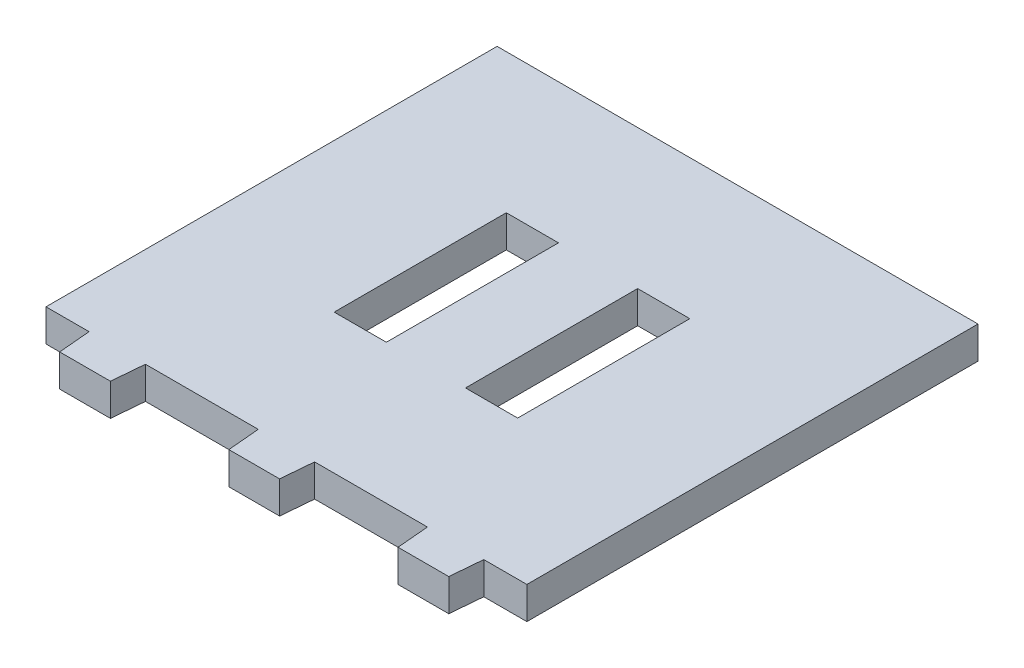
ISO-10303-21;
HEADER;
FILE_DESCRIPTION(('STEP AP214'),'2;1');
FILE_NAME('part.step','',(''),(''),'','','');
FILE_SCHEMA(('AUTOMOTIVE_DESIGN { 1 0 10303 214 1 1 1 1 }'));
ENDSEC;
DATA;
#1=APPLICATION_CONTEXT('core data for automotive mechanical design processes');
#2=APPLICATION_PROTOCOL_DEFINITION('international standard','automotive_design',2000,#1);
#3=PRODUCT_CONTEXT('',#1,'mechanical');
#4=PRODUCT('Part','Part','',(#3));
#5=PRODUCT_RELATED_PRODUCT_CATEGORY('part','',(#4));
#6=PRODUCT_DEFINITION_FORMATION('','',#4);
#7=PRODUCT_DEFINITION_CONTEXT('part definition',#1,'design');
#8=PRODUCT_DEFINITION('design','',#6,#7);
#9=PRODUCT_DEFINITION_SHAPE('','',#8);
#10=(LENGTH_UNIT() NAMED_UNIT(*) SI_UNIT(.MILLI.,.METRE.));
#11=(NAMED_UNIT(*) PLANE_ANGLE_UNIT() SI_UNIT($,.RADIAN.));
#12=(NAMED_UNIT(*) SI_UNIT($,.STERADIAN.) SOLID_ANGLE_UNIT());
#13=UNCERTAINTY_MEASURE_WITH_UNIT(LENGTH_MEASURE(1.E-05),#10,'distance_accuracy_value','');
#14=(GEOMETRIC_REPRESENTATION_CONTEXT(3) GLOBAL_UNCERTAINTY_ASSIGNED_CONTEXT((#13)) GLOBAL_UNIT_ASSIGNED_CONTEXT((#10,
#11,#12)) REPRESENTATION_CONTEXT('',''));
#15=CARTESIAN_POINT('',(0.,0.,0.));
#16=DIRECTION('',(0.,0.,1.));
#17=DIRECTION('',(1.,0.,0.));
#18=AXIS2_PLACEMENT_3D('',#15,#16,#17);
#19=CARTESIAN_POINT('',(0.,5.715,-15.2642187617959));
#20=DIRECTION('',(0.,0.,1.));
#21=DIRECTION('',(1.,0.,0.));
#22=AXIS2_PLACEMENT_3D('',#19,#20,#21);
#23=PLANE('',#22);
#24=DIRECTION('',(-1.,0.,0.));
#25=VECTOR('',#24,1.);
#26=CARTESIAN_POINT('',(0.,0.,-15.2642187617959));
#27=LINE('',#26,#25);
#28=CARTESIAN_POINT('',(16.2715790770451,0.,-15.2642187617959));
#29=VERTEX_POINT('',#28);
#30=CARTESIAN_POINT('',(7.01863603659395,0.,-15.2642187617959));
#31=VERTEX_POINT('',#30);
#32=EDGE_CURVE('E335',#29,#31,#27,.T.);
#33=ORIENTED_EDGE('',*,*,#32,.F.);
#34=DIRECTION('',(0.,-1.,0.));
#35=VECTOR('',#34,1.);
#36=CARTESIAN_POINT('',(16.2715790770451,5.715,-15.2642187617959));
#37=LINE('',#36,#35);
#38=CARTESIAN_POINT('',(16.2715790770451,5.715,-15.2642187617959));
#39=VERTEX_POINT('',#38);
#40=EDGE_CURVE('E11',#39,#29,#37,.T.);
#41=ORIENTED_EDGE('',*,*,#40,.F.);
#42=DIRECTION('',(-1.,0.,0.));
#43=VECTOR('',#42,1.);
#44=CARTESIAN_POINT('',(0.,5.715,-15.2642187617959));
#45=LINE('',#44,#43);
#46=CARTESIAN_POINT('',(7.01863603659395,5.715,-15.2642187617959));
#47=VERTEX_POINT('',#46);
#48=EDGE_CURVE('E215',#39,#47,#45,.T.);
#49=ORIENTED_EDGE('',*,*,#48,.T.);
#50=DIRECTION('',(0.,-1.,0.));
#51=VECTOR('',#50,1.);
#52=CARTESIAN_POINT('',(7.01863603659395,5.715,-15.2642187617959));
#53=LINE('',#52,#51);
#54=EDGE_CURVE('E53',#47,#31,#53,.T.);
#55=ORIENTED_EDGE('',*,*,#54,.T.);
#56=EDGE_LOOP('',(#33,#41,#49,#55));
#57=FACE_BOUND('',#56,.T.);
#58=ADVANCED_FACE('F34',(#57),#23,.T.);
#59=CARTESIAN_POINT('',(16.2715790770451,5.715,0.));
#60=DIRECTION('',(1.,0.,0.));
#61=DIRECTION('',(0.,0.,-1.));
#62=AXIS2_PLACEMENT_3D('',#59,#60,#61);
#63=PLANE('',#62);
#64=DIRECTION('',(0.,0.,1.));
#65=VECTOR('',#64,1.);
#66=CARTESIAN_POINT('',(16.2715790770451,0.,0.));
#67=LINE('',#66,#65);
#68=CARTESIAN_POINT('',(16.2715790770451,0.,15.2642187617959));
#69=VERTEX_POINT('',#68);
#70=EDGE_CURVE('E220',#29,#69,#67,.T.);
#71=ORIENTED_EDGE('',*,*,#70,.T.);
#72=DIRECTION('',(0.,-1.,0.));
#73=VECTOR('',#72,1.);
#74=CARTESIAN_POINT('',(16.2715790770451,5.715,15.2642187617959));
#75=LINE('',#74,#73);
#76=CARTESIAN_POINT('',(16.2715790770451,5.715,15.2642187617959));
#77=VERTEX_POINT('',#76);
#78=EDGE_CURVE('E44',#77,#69,#75,.T.);
#79=ORIENTED_EDGE('',*,*,#78,.F.);
#80=DIRECTION('',(0.,0.,1.));
#81=VECTOR('',#80,1.);
#82=CARTESIAN_POINT('',(16.2715790770451,5.715,0.));
#83=LINE('',#82,#81);
#84=EDGE_CURVE('E210',#39,#77,#83,.T.);
#85=ORIENTED_EDGE('',*,*,#84,.F.);
#86=ORIENTED_EDGE('',*,*,#40,.T.);
#87=EDGE_LOOP('',(#71,#79,#85,#86));
#88=FACE_BOUND('',#87,.T.);
#89=ADVANCED_FACE('F218',(#88),#63,.F.);
#90=CARTESIAN_POINT('',(0.,5.715,15.2642187617959));
#91=DIRECTION('',(0.,0.,1.));
#92=DIRECTION('',(1.,0.,0.));
#93=AXIS2_PLACEMENT_3D('',#90,#91,#92);
#94=PLANE('',#93);
#95=DIRECTION('',(-1.,0.,0.));
#96=VECTOR('',#95,1.);
#97=CARTESIAN_POINT('',(0.,0.,15.2642187617959));
#98=LINE('',#97,#96);
#99=CARTESIAN_POINT('',(7.01863603659395,0.,15.2642187617959));
#100=VERTEX_POINT('',#99);
#101=EDGE_CURVE('E338',#69,#100,#98,.T.);
#102=ORIENTED_EDGE('',*,*,#101,.T.);
#103=DIRECTION('',(0.,-1.,0.));
#104=VECTOR('',#103,1.);
#105=CARTESIAN_POINT('',(7.01863603659395,5.715,15.2642187617959));
#106=LINE('',#105,#104);
#107=CARTESIAN_POINT('',(7.01863603659395,5.715,15.2642187617959));
#108=VERTEX_POINT('',#107);
#109=EDGE_CURVE('E127',#108,#100,#106,.T.);
#110=ORIENTED_EDGE('',*,*,#109,.F.);
#111=DIRECTION('',(-1.,0.,0.));
#112=VECTOR('',#111,1.);
#113=CARTESIAN_POINT('',(0.,5.715,15.2642187617959));
#114=LINE('',#113,#112);
#115=EDGE_CURVE('E202',#77,#108,#114,.T.);
#116=ORIENTED_EDGE('',*,*,#115,.F.);
#117=ORIENTED_EDGE('',*,*,#78,.T.);
#118=EDGE_LOOP('',(#102,#110,#116,#117));
#119=FACE_BOUND('',#118,.T.);
#120=ADVANCED_FACE('F204',(#119),#94,.F.);
#121=CARTESIAN_POINT('',(0.,5.715,-15.2642187617959));
#122=DIRECTION('',(0.,0.,-1.));
#123=DIRECTION('',(-1.,0.,0.));
#124=AXIS2_PLACEMENT_3D('',#121,#122,#123);
#125=PLANE('',#124);
#126=DIRECTION('',(1.,0.,0.));
#127=VECTOR('',#126,1.);
#128=CARTESIAN_POINT('',(0.,0.,-15.2642187617959));
#129=LINE('',#128,#127);
#130=CARTESIAN_POINT('',(-16.2715790770451,0.,-15.2642187617959));
#131=VERTEX_POINT('',#130);
#132=CARTESIAN_POINT('',(-7.01863603659395,0.,-15.2642187617959));
#133=VERTEX_POINT('',#132);
#134=EDGE_CURVE('E323',#131,#133,#129,.T.);
#135=ORIENTED_EDGE('',*,*,#134,.T.);
#136=DIRECTION('',(0.,-1.,0.));
#137=VECTOR('',#136,1.);
#138=CARTESIAN_POINT('',(-7.01863603659395,5.715,-15.2642187617959));
#139=LINE('',#138,#137);
#140=CARTESIAN_POINT('',(-7.01863603659395,5.715,-15.2642187617959));
#141=VERTEX_POINT('',#140);
#142=EDGE_CURVE('E231',#141,#133,#139,.T.);
#143=ORIENTED_EDGE('',*,*,#142,.F.);
#144=DIRECTION('',(1.,0.,0.));
#145=VECTOR('',#144,1.);
#146=CARTESIAN_POINT('',(0.,5.715,-15.2642187617959));
#147=LINE('',#146,#145);
#148=CARTESIAN_POINT('',(-16.2715790770451,5.715,-15.2642187617959));
#149=VERTEX_POINT('',#148);
#150=EDGE_CURVE('E378',#149,#141,#147,.T.);
#151=ORIENTED_EDGE('',*,*,#150,.F.);
#152=DIRECTION('',(0.,-1.,0.));
#153=VECTOR('',#152,1.);
#154=CARTESIAN_POINT('',(-16.2715790770451,5.715,-15.2642187617959));
#155=LINE('',#154,#153);
#156=EDGE_CURVE('E225',#149,#131,#155,.T.);
#157=ORIENTED_EDGE('',*,*,#156,.T.);
#158=EDGE_LOOP('',(#135,#143,#151,#157));
#159=FACE_BOUND('',#158,.T.);
#160=ADVANCED_FACE('F424',(#159),#125,.F.);
#161=CARTESIAN_POINT('',(-7.01863603659395,5.715,0.));
#162=DIRECTION('',(1.,0.,0.));
#163=DIRECTION('',(0.,0.,-1.));
#164=AXIS2_PLACEMENT_3D('',#161,#162,#163);
#165=PLANE('',#164);
#166=DIRECTION('',(0.,0.,1.));
#167=VECTOR('',#166,1.);
#168=CARTESIAN_POINT('',(-7.01863603659395,0.,0.));
#169=LINE('',#168,#167);
#170=CARTESIAN_POINT('',(-7.01863603659395,0.,15.2642187617959));
#171=VERTEX_POINT('',#170);
#172=EDGE_CURVE('E326',#133,#171,#169,.T.);
#173=ORIENTED_EDGE('',*,*,#172,.T.);
#174=DIRECTION('',(0.,-1.,0.));
#175=VECTOR('',#174,1.);
#176=CARTESIAN_POINT('',(-7.01863603659395,5.715,15.2642187617959));
#177=LINE('',#176,#175);
#178=CARTESIAN_POINT('',(-7.01863603659395,5.715,15.2642187617959));
#179=VERTEX_POINT('',#178);
#180=EDGE_CURVE('E229',#179,#171,#177,.T.);
#181=ORIENTED_EDGE('',*,*,#180,.F.);
#182=DIRECTION('',(0.,0.,1.));
#183=VECTOR('',#182,1.);
#184=CARTESIAN_POINT('',(-7.01863603659395,5.715,0.));
#185=LINE('',#184,#183);
#186=EDGE_CURVE('E381',#141,#179,#185,.T.);
#187=ORIENTED_EDGE('',*,*,#186,.F.);
#188=ORIENTED_EDGE('',*,*,#142,.T.);
#189=EDGE_LOOP('',(#173,#181,#187,#188));
#190=FACE_BOUND('',#189,.T.);
#191=ADVANCED_FACE('F420',(#190),#165,.F.);
#192=CARTESIAN_POINT('',(0.,5.715,15.2642187617959));
#193=DIRECTION('',(0.,0.,-1.));
#194=DIRECTION('',(-1.,0.,0.));
#195=AXIS2_PLACEMENT_3D('',#192,#193,#194);
#196=PLANE('',#195);
#197=DIRECTION('',(1.,0.,0.));
#198=VECTOR('',#197,1.);
#199=CARTESIAN_POINT('',(0.,0.,15.2642187617959));
#200=LINE('',#199,#198);
#201=CARTESIAN_POINT('',(-16.2715790770451,0.,15.2642187617959));
#202=VERTEX_POINT('',#201);
#203=EDGE_CURVE('E329',#202,#171,#200,.T.);
#204=ORIENTED_EDGE('',*,*,#203,.F.);
#205=DIRECTION('',(0.,-1.,0.));
#206=VECTOR('',#205,1.);
#207=CARTESIAN_POINT('',(-16.2715790770451,5.715,15.2642187617959));
#208=LINE('',#207,#206);
#209=CARTESIAN_POINT('',(-16.2715790770451,5.715,15.2642187617959));
#210=VERTEX_POINT('',#209);
#211=EDGE_CURVE('E227',#210,#202,#208,.T.);
#212=ORIENTED_EDGE('',*,*,#211,.F.);
#213=DIRECTION('',(1.,0.,0.));
#214=VECTOR('',#213,1.);
#215=CARTESIAN_POINT('',(0.,5.715,15.2642187617959));
#216=LINE('',#215,#214);
#217=EDGE_CURVE('E383',#210,#179,#216,.T.);
#218=ORIENTED_EDGE('',*,*,#217,.T.);
#219=ORIENTED_EDGE('',*,*,#180,.T.);
#220=EDGE_LOOP('',(#204,#212,#218,#219));
#221=FACE_BOUND('',#220,.T.);
#222=ADVANCED_FACE('F417',(#221),#196,.T.);
#223=CARTESIAN_POINT('',(42.6397952780144,5.715,0.));
#224=DIRECTION('',(1.,0.,0.));
#225=DIRECTION('',(0.,0.,-1.));
#226=AXIS2_PLACEMENT_3D('',#223,#224,#225);
#227=PLANE('',#226);
#228=DIRECTION('',(0.,0.,1.));
#229=VECTOR('',#228,1.);
#230=CARTESIAN_POINT('',(42.6397952780144,0.,0.));
#231=LINE('',#230,#229);
#232=CARTESIAN_POINT('',(42.6397952780144,0.,-40.));
#233=VERTEX_POINT('',#232);
#234=CARTESIAN_POINT('',(42.6397952780144,0.,40.));
#235=VERTEX_POINT('',#234);
#236=EDGE_CURVE('E279',#233,#235,#231,.T.);
#237=ORIENTED_EDGE('',*,*,#236,.F.);
#238=DIRECTION('',(0.,-1.,0.));
#239=VECTOR('',#238,1.);
#240=CARTESIAN_POINT('',(42.6397952780144,5.715,-40.));
#241=LINE('',#240,#239);
#242=CARTESIAN_POINT('',(42.6397952780144,5.715,-40.));
#243=VERTEX_POINT('',#242);
#244=EDGE_CURVE('E38',#243,#233,#241,.T.);
#245=ORIENTED_EDGE('',*,*,#244,.F.);
#246=DIRECTION('',(0.,0.,1.));
#247=VECTOR('',#246,1.);
#248=CARTESIAN_POINT('',(42.6397952780144,5.715,0.));
#249=LINE('',#248,#247);
#250=CARTESIAN_POINT('',(42.6397952780144,5.715,40.));
#251=VERTEX_POINT('',#250);
#252=EDGE_CURVE('E342',#243,#251,#249,.T.);
#253=ORIENTED_EDGE('',*,*,#252,.T.);
#254=DIRECTION('',(0.,-1.,0.));
#255=VECTOR('',#254,1.);
#256=CARTESIAN_POINT('',(42.6397952780144,5.715,40.));
#257=LINE('',#256,#255);
#258=EDGE_CURVE('E234',#251,#235,#257,.T.);
#259=ORIENTED_EDGE('',*,*,#258,.T.);
#260=EDGE_LOOP('',(#237,#245,#253,#259));
#261=FACE_BOUND('',#260,.T.);
#262=ADVANCED_FACE('F36',(#261),#227,.T.);
#263=CARTESIAN_POINT('',(0.,5.715,-40.));
#264=DIRECTION('',(0.,0.,-1.));
#265=DIRECTION('',(-1.,0.,0.));
#266=AXIS2_PLACEMENT_3D('',#263,#264,#265);
#267=PLANE('',#266);
#268=DIRECTION('',(1.,0.,0.));
#269=VECTOR('',#268,1.);
#270=CARTESIAN_POINT('',(0.,0.,-40.));
#271=LINE('',#270,#269);
#272=CARTESIAN_POINT('',(-42.6397952780144,0.,-40.));
#273=VERTEX_POINT('',#272);
#274=EDGE_CURVE('E275',#273,#233,#271,.T.);
#275=ORIENTED_EDGE('',*,*,#274,.F.);
#276=DIRECTION('',(0.,-1.,0.));
#277=VECTOR('',#276,1.);
#278=CARTESIAN_POINT('',(-42.6397952780144,5.715,-40.));
#279=LINE('',#278,#277);
#280=CARTESIAN_POINT('',(-42.6397952780144,5.715,-40.));
#281=VERTEX_POINT('',#280);
#282=EDGE_CURVE('E266',#281,#273,#279,.T.);
#283=ORIENTED_EDGE('',*,*,#282,.F.);
#284=DIRECTION('',(1.,0.,0.));
#285=VECTOR('',#284,1.);
#286=CARTESIAN_POINT('',(0.,5.715,-40.));
#287=LINE('',#286,#285);
#288=EDGE_CURVE('E277',#281,#243,#287,.T.);
#289=ORIENTED_EDGE('',*,*,#288,.T.);
#290=ORIENTED_EDGE('',*,*,#244,.T.);
#291=EDGE_LOOP('',(#275,#283,#289,#290));
#292=FACE_BOUND('',#291,.T.);
#293=ADVANCED_FACE('F273',(#292),#267,.T.);
#294=CARTESIAN_POINT('',(-42.6397952780144,5.715,0.));
#295=DIRECTION('',(1.,0.,0.));
#296=DIRECTION('',(0.,0.,-1.));
#297=AXIS2_PLACEMENT_3D('',#294,#295,#296);
#298=PLANE('',#297);
#299=DIRECTION('',(0.,0.,1.));
#300=VECTOR('',#299,1.);
#301=CARTESIAN_POINT('',(-42.6397952780144,0.,0.));
#302=LINE('',#301,#300);
#303=CARTESIAN_POINT('',(-42.6397952780144,0.,40.));
#304=VERTEX_POINT('',#303);
#305=EDGE_CURVE('E288',#273,#304,#302,.T.);
#306=ORIENTED_EDGE('',*,*,#305,.T.);
#307=DIRECTION('',(0.,-1.,0.));
#308=VECTOR('',#307,1.);
#309=CARTESIAN_POINT('',(-42.6397952780144,5.715,40.));
#310=LINE('',#309,#308);
#311=CARTESIAN_POINT('',(-42.6397952780144,5.715,40.));
#312=VERTEX_POINT('',#311);
#313=EDGE_CURVE('E264',#312,#304,#310,.T.);
#314=ORIENTED_EDGE('',*,*,#313,.F.);
#315=DIRECTION('',(0.,0.,1.));
#316=VECTOR('',#315,1.);
#317=CARTESIAN_POINT('',(-42.6397952780144,5.715,0.));
#318=LINE('',#317,#316);
#319=EDGE_CURVE('E345',#281,#312,#318,.T.);
#320=ORIENTED_EDGE('',*,*,#319,.F.);
#321=ORIENTED_EDGE('',*,*,#282,.T.);
#322=EDGE_LOOP('',(#306,#314,#320,#321));
#323=FACE_BOUND('',#322,.T.);
#324=ADVANCED_FACE('F465',(#323),#298,.F.);
#325=CARTESIAN_POINT('',(0.,5.715,40.));
#326=DIRECTION('',(0.,0.,-1.));
#327=DIRECTION('',(-1.,0.,0.));
#328=AXIS2_PLACEMENT_3D('',#325,#326,#327);
#329=PLANE('',#328);
#330=DIRECTION('',(1.,0.,0.));
#331=VECTOR('',#330,1.);
#332=CARTESIAN_POINT('',(0.,0.,40.));
#333=LINE('',#332,#331);
#334=CARTESIAN_POINT('',(-35.,0.,40.));
#335=VERTEX_POINT('',#334);
#336=EDGE_CURVE('E290',#304,#335,#333,.T.);
#337=ORIENTED_EDGE('',*,*,#336,.T.);
#338=DIRECTION('',(0.,-1.,0.));
#339=VECTOR('',#338,1.);
#340=CARTESIAN_POINT('',(-35.,5.715,40.));
#341=LINE('',#340,#339);
#342=CARTESIAN_POINT('',(-35.,5.715,40.));
#343=VERTEX_POINT('',#342);
#344=EDGE_CURVE('E262',#343,#335,#341,.T.);
#345=ORIENTED_EDGE('',*,*,#344,.F.);
#346=DIRECTION('',(1.,0.,0.));
#347=VECTOR('',#346,1.);
#348=CARTESIAN_POINT('',(0.,5.715,40.));
#349=LINE('',#348,#347);
#350=EDGE_CURVE('E349',#312,#343,#349,.T.);
#351=ORIENTED_EDGE('',*,*,#350,.F.);
#352=ORIENTED_EDGE('',*,*,#313,.T.);
#353=EDGE_LOOP('',(#337,#345,#351,#352));
#354=FACE_BOUND('',#353,.T.);
#355=ADVANCED_FACE('F402',(#354),#329,.F.);
#356=CARTESIAN_POINT('',(-38.2071124669471,5.715,3.34270450279502));
#357=DIRECTION('',(-0.996194663464687,0.,0.0871561385358432));
#358=DIRECTION('',(0.0871561385358432,0.,0.996194663464687));
#359=AXIS2_PLACEMENT_3D('',#356,#357,#358);
#360=PLANE('',#359);
#361=DIRECTION('',(-0.0871561385358432,0.,-0.996194663464687));
#362=VECTOR('',#361,1.);
#363=CARTESIAN_POINT('',(-38.2071124669471,0.,3.34270450279502));
#364=LINE('',#363,#362);
#365=CARTESIAN_POINT('',(-34.5,0.,45.715));
#366=VERTEX_POINT('',#365);
#367=EDGE_CURVE('E296',#366,#335,#364,.T.);
#368=ORIENTED_EDGE('',*,*,#367,.F.);
#369=DIRECTION('',(0.,-1.,0.));
#370=VECTOR('',#369,1.);
#371=CARTESIAN_POINT('',(-34.5,5.715,45.715));
#372=LINE('',#371,#370);
#373=CARTESIAN_POINT('',(-34.5,5.715,45.715));
#374=VERTEX_POINT('',#373);
#375=EDGE_CURVE('E260',#374,#366,#372,.T.);
#376=ORIENTED_EDGE('',*,*,#375,.F.);
#377=DIRECTION('',(-0.0871561385358432,0.,-0.996194663464687));
#378=VECTOR('',#377,1.);
#379=CARTESIAN_POINT('',(-38.2071124669471,5.715,3.34270450279502));
#380=LINE('',#379,#378);
#381=EDGE_CURVE('E351',#374,#343,#380,.T.);
#382=ORIENTED_EDGE('',*,*,#381,.T.);
#383=ORIENTED_EDGE('',*,*,#344,.T.);
#384=EDGE_LOOP('',(#368,#376,#382,#383));
#385=FACE_BOUND('',#384,.T.);
#386=ADVANCED_FACE('F460',(#385),#360,.T.);
#387=CARTESIAN_POINT('',(0.,5.715,45.715));
#388=DIRECTION('',(0.,0.,1.));
#389=DIRECTION('',(1.,0.,0.));
#390=AXIS2_PLACEMENT_3D('',#387,#388,#389);
#391=PLANE('',#390);
#392=DIRECTION('',(-1.,0.,0.));
#393=VECTOR('',#392,1.);
#394=CARTESIAN_POINT('',(0.,0.,45.715));
#395=LINE('',#394,#393);
#396=CARTESIAN_POINT('',(-25.5,0.,45.715));
#397=VERTEX_POINT('',#396);
#398=EDGE_CURVE('E301',#397,#366,#395,.T.);
#399=ORIENTED_EDGE('',*,*,#398,.F.);
#400=DIRECTION('',(0.,-1.,0.));
#401=VECTOR('',#400,1.);
#402=CARTESIAN_POINT('',(-25.5,5.715,45.715));
#403=LINE('',#402,#401);
#404=CARTESIAN_POINT('',(-25.5,5.715,45.715));
#405=VERTEX_POINT('',#404);
#406=EDGE_CURVE('E258',#405,#397,#403,.T.);
#407=ORIENTED_EDGE('',*,*,#406,.F.);
#408=DIRECTION('',(-1.,0.,0.));
#409=VECTOR('',#408,1.);
#410=CARTESIAN_POINT('',(0.,5.715,45.715));
#411=LINE('',#410,#409);
#412=EDGE_CURVE('E356',#405,#374,#411,.T.);
#413=ORIENTED_EDGE('',*,*,#412,.T.);
#414=ORIENTED_EDGE('',*,*,#375,.T.);
#415=EDGE_LOOP('',(#399,#407,#413,#414));
#416=FACE_BOUND('',#415,.T.);
#417=ADVANCED_FACE('F456',(#416),#391,.T.);
#418=CARTESIAN_POINT('',(-21.3371159839842,5.715,-1.86676430306075));
#419=DIRECTION('',(0.996194663464687,0.,0.0871561385358438));
#420=DIRECTION('',(0.0871561385358438,0.,-0.996194663464687));
#421=AXIS2_PLACEMENT_3D('',#418,#419,#420);
#422=PLANE('',#421);
#423=DIRECTION('',(-0.0871561385358438,0.,0.996194663464687));
#424=VECTOR('',#423,1.);
#425=CARTESIAN_POINT('',(-21.3371159839842,0.,-1.86676430306075));
#426=LINE('',#425,#424);
#427=CARTESIAN_POINT('',(-25.,0.,40.));
#428=VERTEX_POINT('',#427);
#429=EDGE_CURVE('E304',#428,#397,#426,.T.);
#430=ORIENTED_EDGE('',*,*,#429,.F.);
#431=DIRECTION('',(0.,-1.,0.));
#432=VECTOR('',#431,1.);
#433=CARTESIAN_POINT('',(-25.,5.715,40.));
#434=LINE('',#433,#432);
#435=CARTESIAN_POINT('',(-25.,5.715,40.));
#436=VERTEX_POINT('',#435);
#437=EDGE_CURVE('E256',#436,#428,#434,.T.);
#438=ORIENTED_EDGE('',*,*,#437,.F.);
#439=DIRECTION('',(-0.0871561385358438,0.,0.996194663464687));
#440=VECTOR('',#439,1.);
#441=CARTESIAN_POINT('',(-21.3371159839842,5.715,-1.86676430306075));
#442=LINE('',#441,#440);
#443=EDGE_CURVE('E359',#436,#405,#442,.T.);
#444=ORIENTED_EDGE('',*,*,#443,.T.);
#445=ORIENTED_EDGE('',*,*,#406,.T.);
#446=EDGE_LOOP('',(#430,#438,#444,#445));
#447=FACE_BOUND('',#446,.T.);
#448=ADVANCED_FACE('F453',(#447),#422,.T.);
#449=CARTESIAN_POINT('',(-5.,0.,40.));
#450=VERTEX_POINT('',#449);
#451=EDGE_CURVE('E298',#428,#450,#333,.T.);
#452=ORIENTED_EDGE('',*,*,#451,.T.);
#453=DIRECTION('',(0.,-1.,0.));
#454=VECTOR('',#453,1.);
#455=CARTESIAN_POINT('',(-5.,5.715,40.));
#456=LINE('',#455,#454);
#457=CARTESIAN_POINT('',(-5.,5.715,40.));
#458=VERTEX_POINT('',#457);
#459=EDGE_CURVE('E254',#458,#450,#456,.T.);
#460=ORIENTED_EDGE('',*,*,#459,.F.);
#461=EDGE_CURVE('E353',#436,#458,#349,.T.);
#462=ORIENTED_EDGE('',*,*,#461,.F.);
#463=ORIENTED_EDGE('',*,*,#437,.T.);
#464=EDGE_LOOP('',(#452,#460,#462,#463));
#465=FACE_BOUND('',#464,.T.);
#466=ADVANCED_FACE('F451',(#465),#329,.F.);
#467=CARTESIAN_POINT('',(-8.43499824148148,5.715,0.737970099867155));
#468=DIRECTION('',(-0.996194663464687,0.,0.0871561385358441));
#469=DIRECTION('',(0.0871561385358441,0.,0.996194663464687));
#470=AXIS2_PLACEMENT_3D('',#467,#468,#469);
#471=PLANE('',#470);
#472=DIRECTION('',(-0.0871561385358441,0.,-0.996194663464687));
#473=VECTOR('',#472,1.);
#474=CARTESIAN_POINT('',(-8.43499824148148,0.,0.737970099867155));
#475=LINE('',#474,#473);
#476=CARTESIAN_POINT('',(-4.49999999999999,0.,45.715));
#477=VERTEX_POINT('',#476);
#478=EDGE_CURVE('E307',#477,#450,#475,.T.);
#479=ORIENTED_EDGE('',*,*,#478,.F.);
#480=DIRECTION('',(0.,-1.,0.));
#481=VECTOR('',#480,1.);
#482=CARTESIAN_POINT('',(-4.49999999999999,5.715,45.715));
#483=LINE('',#482,#481);
#484=CARTESIAN_POINT('',(-4.49999999999999,5.715,45.715));
#485=VERTEX_POINT('',#484);
#486=EDGE_CURVE('E252',#485,#477,#483,.T.);
#487=ORIENTED_EDGE('',*,*,#486,.F.);
#488=DIRECTION('',(-0.0871561385358441,0.,-0.996194663464687));
#489=VECTOR('',#488,1.);
#490=CARTESIAN_POINT('',(-8.43499824148148,5.715,0.737970099867155));
#491=LINE('',#490,#489);
#492=EDGE_CURVE('E362',#485,#458,#491,.T.);
#493=ORIENTED_EDGE('',*,*,#492,.T.);
#494=ORIENTED_EDGE('',*,*,#459,.T.);
#495=EDGE_LOOP('',(#479,#487,#493,#494));
#496=FACE_BOUND('',#495,.T.);
#497=ADVANCED_FACE('F447',(#496),#471,.T.);
#498=CARTESIAN_POINT('',(0.,5.715,45.715));
#499=DIRECTION('',(0.,0.,1.));
#500=DIRECTION('',(1.,0.,0.));
#501=AXIS2_PLACEMENT_3D('',#498,#499,#500);
#502=PLANE('',#501);
#503=DIRECTION('',(-1.,0.,0.));
#504=VECTOR('',#503,1.);
#505=CARTESIAN_POINT('',(0.,0.,45.715));
#506=LINE('',#505,#504);
#507=CARTESIAN_POINT('',(4.50000000000001,0.,45.715));
#508=VERTEX_POINT('',#507);
#509=EDGE_CURVE('E310',#508,#477,#506,.T.);
#510=ORIENTED_EDGE('',*,*,#509,.F.);
#511=DIRECTION('',(0.,-1.,0.));
#512=VECTOR('',#511,1.);
#513=CARTESIAN_POINT('',(4.50000000000001,5.715,45.715));
#514=LINE('',#513,#512);
#515=CARTESIAN_POINT('',(4.50000000000001,5.715,45.715));
#516=VERTEX_POINT('',#515);
#517=EDGE_CURVE('E250',#516,#508,#514,.T.);
#518=ORIENTED_EDGE('',*,*,#517,.F.);
#519=DIRECTION('',(-1.,0.,0.));
#520=VECTOR('',#519,1.);
#521=CARTESIAN_POINT('',(0.,5.715,45.715));
#522=LINE('',#521,#520);
#523=EDGE_CURVE('E365',#516,#485,#522,.T.);
#524=ORIENTED_EDGE('',*,*,#523,.T.);
#525=ORIENTED_EDGE('',*,*,#486,.T.);
#526=EDGE_LOOP('',(#510,#518,#524,#525));
#527=FACE_BOUND('',#526,.T.);
#528=ADVANCED_FACE('F443',(#527),#502,.T.);
#529=CARTESIAN_POINT('',(8.43499824148142,5.715,0.737970099867137));
#530=DIRECTION('',(0.996194663464687,0.,0.0871561385358426));
#531=DIRECTION('',(0.0871561385358426,0.,-0.996194663464687));
#532=AXIS2_PLACEMENT_3D('',#529,#530,#531);
#533=PLANE('',#532);
#534=DIRECTION('',(-0.0871561385358426,0.,0.996194663464687));
#535=VECTOR('',#534,1.);
#536=CARTESIAN_POINT('',(8.43499824148142,0.,0.737970099867137));
#537=LINE('',#536,#535);
#538=CARTESIAN_POINT('',(5.,0.,40.));
#539=VERTEX_POINT('',#538);
#540=EDGE_CURVE('E313',#539,#508,#537,.T.);
#541=ORIENTED_EDGE('',*,*,#540,.F.);
#542=DIRECTION('',(0.,-1.,0.));
#543=VECTOR('',#542,1.);
#544=CARTESIAN_POINT('',(5.,5.715,40.));
#545=LINE('',#544,#543);
#546=CARTESIAN_POINT('',(5.,5.715,40.));
#547=VERTEX_POINT('',#546);
#548=EDGE_CURVE('E248',#547,#539,#545,.T.);
#549=ORIENTED_EDGE('',*,*,#548,.F.);
#550=DIRECTION('',(-0.0871561385358426,0.,0.996194663464687));
#551=VECTOR('',#550,1.);
#552=CARTESIAN_POINT('',(8.43499824148142,5.715,0.737970099867137));
#553=LINE('',#552,#551);
#554=EDGE_CURVE('E368',#547,#516,#553,.T.);
#555=ORIENTED_EDGE('',*,*,#554,.T.);
#556=ORIENTED_EDGE('',*,*,#517,.T.);
#557=EDGE_LOOP('',(#541,#549,#555,#556));
#558=FACE_BOUND('',#557,.T.);
#559=ADVANCED_FACE('F440',(#558),#533,.T.);
#560=CARTESIAN_POINT('',(25.,0.,40.));
#561=VERTEX_POINT('',#560);
#562=EDGE_CURVE('E316',#539,#561,#333,.T.);
#563=ORIENTED_EDGE('',*,*,#562,.T.);
#564=DIRECTION('',(0.,-1.,0.));
#565=VECTOR('',#564,1.);
#566=CARTESIAN_POINT('',(25.,5.715,40.));
#567=LINE('',#566,#565);
#568=CARTESIAN_POINT('',(25.,5.715,40.));
#569=VERTEX_POINT('',#568);
#570=EDGE_CURVE('E245',#569,#561,#567,.T.);
#571=ORIENTED_EDGE('',*,*,#570,.F.);
#572=EDGE_CURVE('E371',#547,#569,#349,.T.);
#573=ORIENTED_EDGE('',*,*,#572,.F.);
#574=ORIENTED_EDGE('',*,*,#548,.T.);
#575=EDGE_LOOP('',(#563,#571,#573,#574));
#576=FACE_BOUND('',#575,.T.);
#577=ADVANCED_FACE('F403',(#576),#329,.F.);
#578=CARTESIAN_POINT('',(21.3371159839842,5.715,-1.86676430306075));
#579=DIRECTION('',(0.996194663464687,0.,-0.0871561385358439));
#580=DIRECTION('',(-0.087156138535844,0.,-0.996194663464687));
#581=AXIS2_PLACEMENT_3D('',#578,#579,#580);
#582=PLANE('',#581);
#583=DIRECTION('',(0.0871561385358439,0.,0.996194663464687));
#584=VECTOR('',#583,1.);
#585=CARTESIAN_POINT('',(21.3371159839842,0.,-1.86676430306075));
#586=LINE('',#585,#584);
#587=CARTESIAN_POINT('',(25.5,0.,45.715));
#588=VERTEX_POINT('',#587);
#589=EDGE_CURVE('E317',#561,#588,#586,.T.);
#590=ORIENTED_EDGE('',*,*,#589,.T.);
#591=DIRECTION('',(0.,-1.,0.));
#592=VECTOR('',#591,1.);
#593=CARTESIAN_POINT('',(25.5,5.715,45.715));
#594=LINE('',#593,#592);
#595=CARTESIAN_POINT('',(25.5,5.715,45.715));
#596=VERTEX_POINT('',#595);
#597=EDGE_CURVE('E242',#596,#588,#594,.T.);
#598=ORIENTED_EDGE('',*,*,#597,.F.);
#599=DIRECTION('',(0.0871561385358439,0.,0.996194663464687));
#600=VECTOR('',#599,1.);
#601=CARTESIAN_POINT('',(21.3371159839842,5.715,-1.86676430306075));
#602=LINE('',#601,#600);
#603=EDGE_CURVE('E372',#569,#596,#602,.T.);
#604=ORIENTED_EDGE('',*,*,#603,.F.);
#605=ORIENTED_EDGE('',*,*,#570,.T.);
#606=EDGE_LOOP('',(#590,#598,#604,#605));
#607=FACE_BOUND('',#606,.T.);
#608=ADVANCED_FACE('F435',(#607),#582,.F.);
#609=CARTESIAN_POINT('',(0.,5.715,45.715));
#610=DIRECTION('',(0.,0.,-1.));
#611=DIRECTION('',(-1.,0.,0.));
#612=AXIS2_PLACEMENT_3D('',#609,#610,#611);
#613=PLANE('',#612);
#614=DIRECTION('',(1.,0.,0.));
#615=VECTOR('',#614,1.);
#616=CARTESIAN_POINT('',(0.,0.,45.715));
#617=LINE('',#616,#615);
#618=CARTESIAN_POINT('',(34.5,0.,45.715));
#619=VERTEX_POINT('',#618);
#620=EDGE_CURVE('E319',#588,#619,#617,.T.);
#621=ORIENTED_EDGE('',*,*,#620,.T.);
#622=DIRECTION('',(0.,-1.,0.));
#623=VECTOR('',#622,1.);
#624=CARTESIAN_POINT('',(34.5,5.715,45.715));
#625=LINE('',#624,#623);
#626=CARTESIAN_POINT('',(34.5,5.715,45.715));
#627=VERTEX_POINT('',#626);
#628=EDGE_CURVE('E239',#627,#619,#625,.T.);
#629=ORIENTED_EDGE('',*,*,#628,.F.);
#630=DIRECTION('',(1.,0.,0.));
#631=VECTOR('',#630,1.);
#632=CARTESIAN_POINT('',(0.,5.715,45.715));
#633=LINE('',#632,#631);
#634=EDGE_CURVE('E374',#596,#627,#633,.T.);
#635=ORIENTED_EDGE('',*,*,#634,.F.);
#636=ORIENTED_EDGE('',*,*,#597,.T.);
#637=EDGE_LOOP('',(#621,#629,#635,#636));
#638=FACE_BOUND('',#637,.T.);
#639=ADVANCED_FACE('F431',(#638),#613,.F.);
#640=CARTESIAN_POINT('',(38.2071124669471,5.715,3.34270450279503));
#641=DIRECTION('',(-0.996194663464687,0.,-0.0871561385358433));
#642=DIRECTION('',(-0.0871561385358433,0.,0.996194663464687));
#643=AXIS2_PLACEMENT_3D('',#640,#641,#642);
#644=PLANE('',#643);
#645=DIRECTION('',(0.0871561385358433,0.,-0.996194663464687));
#646=VECTOR('',#645,1.);
#647=CARTESIAN_POINT('',(38.2071124669471,0.,3.34270450279503));
#648=LINE('',#647,#646);
#649=CARTESIAN_POINT('',(35.,0.,40.));
#650=VERTEX_POINT('',#649);
#651=EDGE_CURVE('E321',#619,#650,#648,.T.);
#652=ORIENTED_EDGE('',*,*,#651,.T.);
#653=DIRECTION('',(0.,-1.,0.));
#654=VECTOR('',#653,1.);
#655=CARTESIAN_POINT('',(35.,5.715,40.));
#656=LINE('',#655,#654);
#657=CARTESIAN_POINT('',(35.,5.715,40.));
#658=VERTEX_POINT('',#657);
#659=EDGE_CURVE('E236',#658,#650,#656,.T.);
#660=ORIENTED_EDGE('',*,*,#659,.F.);
#661=DIRECTION('',(0.0871561385358433,0.,-0.996194663464687));
#662=VECTOR('',#661,1.);
#663=CARTESIAN_POINT('',(38.2071124669471,5.715,3.34270450279503));
#664=LINE('',#663,#662);
#665=EDGE_CURVE('E376',#627,#658,#664,.T.);
#666=ORIENTED_EDGE('',*,*,#665,.F.);
#667=ORIENTED_EDGE('',*,*,#628,.T.);
#668=EDGE_LOOP('',(#652,#660,#666,#667));
#669=FACE_BOUND('',#668,.T.);
#670=ADVANCED_FACE('F415',(#669),#644,.F.);
#671=CARTESIAN_POINT('',(-16.2715790770451,5.715,0.));
#672=DIRECTION('',(1.,0.,0.));
#673=DIRECTION('',(0.,0.,-1.));
#674=AXIS2_PLACEMENT_3D('',#671,#672,#673);
#675=PLANE('',#674);
#676=DIRECTION('',(0.,0.,1.));
#677=VECTOR('',#676,1.);
#678=CARTESIAN_POINT('',(-16.2715790770451,0.,0.));
#679=LINE('',#678,#677);
#680=EDGE_CURVE('E332',#131,#202,#679,.T.);
#681=ORIENTED_EDGE('',*,*,#680,.F.);
#682=ORIENTED_EDGE('',*,*,#156,.F.);
#683=DIRECTION('',(0.,0.,1.));
#684=VECTOR('',#683,1.);
#685=CARTESIAN_POINT('',(-16.2715790770451,5.715,0.));
#686=LINE('',#685,#684);
#687=EDGE_CURVE('E386',#149,#210,#686,.T.);
#688=ORIENTED_EDGE('',*,*,#687,.T.);
#689=ORIENTED_EDGE('',*,*,#211,.T.);
#690=EDGE_LOOP('',(#681,#682,#688,#689));
#691=FACE_BOUND('',#690,.T.);
#692=ADVANCED_FACE('F399',(#691),#675,.T.);
#693=EDGE_CURVE('E297',#650,#235,#333,.T.);
#694=ORIENTED_EDGE('',*,*,#693,.T.);
#695=ORIENTED_EDGE('',*,*,#258,.F.);
#696=EDGE_CURVE('E352',#658,#251,#349,.T.);
#697=ORIENTED_EDGE('',*,*,#696,.F.);
#698=ORIENTED_EDGE('',*,*,#659,.T.);
#699=EDGE_LOOP('',(#694,#695,#697,#698));
#700=FACE_BOUND('',#699,.T.);
#701=ADVANCED_FACE('F391',(#700),#329,.F.);
#702=CARTESIAN_POINT('',(7.01863603659395,5.715,0.));
#703=DIRECTION('',(1.,0.,0.));
#704=DIRECTION('',(0.,0.,-1.));
#705=AXIS2_PLACEMENT_3D('',#702,#703,#704);
#706=PLANE('',#705);
#707=DIRECTION('',(0.,0.,1.));
#708=VECTOR('',#707,1.);
#709=CARTESIAN_POINT('',(7.01863603659395,0.,0.));
#710=LINE('',#709,#708);
#711=EDGE_CURVE('E340',#31,#100,#710,.T.);
#712=ORIENTED_EDGE('',*,*,#711,.F.);
#713=ORIENTED_EDGE('',*,*,#54,.F.);
#714=DIRECTION('',(0.,0.,1.));
#715=VECTOR('',#714,1.);
#716=CARTESIAN_POINT('',(7.01863603659395,5.715,0.));
#717=LINE('',#716,#715);
#718=EDGE_CURVE('E209',#47,#108,#717,.T.);
#719=ORIENTED_EDGE('',*,*,#718,.T.);
#720=ORIENTED_EDGE('',*,*,#109,.T.);
#721=EDGE_LOOP('',(#712,#713,#719,#720));
#722=FACE_BOUND('',#721,.T.);
#723=ADVANCED_FACE('F389',(#722),#706,.T.);
#724=CARTESIAN_POINT('',(0.,5.715,0.));
#725=DIRECTION('',(0.,1.,0.));
#726=DIRECTION('',(0.,0.,1.));
#727=AXIS2_PLACEMENT_3D('',#724,#725,#726);
#728=PLANE('',#727);
#729=ORIENTED_EDGE('',*,*,#252,.F.);
#730=ORIENTED_EDGE('',*,*,#288,.F.);
#731=ORIENTED_EDGE('',*,*,#319,.T.);
#732=ORIENTED_EDGE('',*,*,#350,.T.);
#733=ORIENTED_EDGE('',*,*,#381,.F.);
#734=ORIENTED_EDGE('',*,*,#412,.F.);
#735=ORIENTED_EDGE('',*,*,#443,.F.);
#736=ORIENTED_EDGE('',*,*,#461,.T.);
#737=ORIENTED_EDGE('',*,*,#492,.F.);
#738=ORIENTED_EDGE('',*,*,#523,.F.);
#739=ORIENTED_EDGE('',*,*,#554,.F.);
#740=ORIENTED_EDGE('',*,*,#572,.T.);
#741=ORIENTED_EDGE('',*,*,#603,.T.);
#742=ORIENTED_EDGE('',*,*,#634,.T.);
#743=ORIENTED_EDGE('',*,*,#665,.T.);
#744=ORIENTED_EDGE('',*,*,#696,.T.);
#745=EDGE_LOOP('',(#729,#730,#731,#732,#733,#734,#735,#736,#737,#738,#739,#740,#741,#742,#743,#744));
#746=FACE_BOUND('',#745,.T.);
#747=ORIENTED_EDGE('',*,*,#150,.T.);
#748=ORIENTED_EDGE('',*,*,#186,.T.);
#749=ORIENTED_EDGE('',*,*,#217,.F.);
#750=ORIENTED_EDGE('',*,*,#687,.F.);
#751=EDGE_LOOP('',(#747,#748,#749,#750));
#752=FACE_BOUND('',#751,.T.);
#753=ORIENTED_EDGE('',*,*,#48,.F.);
#754=ORIENTED_EDGE('',*,*,#84,.T.);
#755=ORIENTED_EDGE('',*,*,#115,.T.);
#756=ORIENTED_EDGE('',*,*,#718,.F.);
#757=EDGE_LOOP('',(#753,#754,#755,#756));
#758=FACE_BOUND('',#757,.T.);
#759=ADVANCED_FACE('F214',(#746,#752,#758),#728,.T.);
#760=CARTESIAN_POINT('',(0.,0.,0.));
#761=DIRECTION('',(0.,1.,0.));
#762=DIRECTION('',(0.,0.,1.));
#763=AXIS2_PLACEMENT_3D('',#760,#761,#762);
#764=PLANE('',#763);
#765=ORIENTED_EDGE('',*,*,#236,.T.);
#766=ORIENTED_EDGE('',*,*,#693,.F.);
#767=ORIENTED_EDGE('',*,*,#651,.F.);
#768=ORIENTED_EDGE('',*,*,#620,.F.);
#769=ORIENTED_EDGE('',*,*,#589,.F.);
#770=ORIENTED_EDGE('',*,*,#562,.F.);
#771=ORIENTED_EDGE('',*,*,#540,.T.);
#772=ORIENTED_EDGE('',*,*,#509,.T.);
#773=ORIENTED_EDGE('',*,*,#478,.T.);
#774=ORIENTED_EDGE('',*,*,#451,.F.);
#775=ORIENTED_EDGE('',*,*,#429,.T.);
#776=ORIENTED_EDGE('',*,*,#398,.T.);
#777=ORIENTED_EDGE('',*,*,#367,.T.);
#778=ORIENTED_EDGE('',*,*,#336,.F.);
#779=ORIENTED_EDGE('',*,*,#305,.F.);
#780=ORIENTED_EDGE('',*,*,#274,.T.);
#781=EDGE_LOOP('',(#765,#766,#767,#768,#769,#770,#771,#772,#773,#774,#775,#776,#777,#778,#779,#780));
#782=FACE_BOUND('',#781,.T.);
#783=ORIENTED_EDGE('',*,*,#134,.F.);
#784=ORIENTED_EDGE('',*,*,#680,.T.);
#785=ORIENTED_EDGE('',*,*,#203,.T.);
#786=ORIENTED_EDGE('',*,*,#172,.F.);
#787=EDGE_LOOP('',(#783,#784,#785,#786));
#788=FACE_BOUND('',#787,.T.);
#789=ORIENTED_EDGE('',*,*,#32,.T.);
#790=ORIENTED_EDGE('',*,*,#711,.T.);
#791=ORIENTED_EDGE('',*,*,#101,.F.);
#792=ORIENTED_EDGE('',*,*,#70,.F.);
#793=EDGE_LOOP('',(#789,#790,#791,#792));
#794=FACE_BOUND('',#793,.T.);
#795=ADVANCED_FACE('F285',(#782,#788,#794),#764,.F.);
#796=CLOSED_SHELL('',(#58,#89,#120,#160,#191,#222,#262,#293,#324,#355,#386,#417,#448,#466,#497,
#528,#559,#577,#608,#639,#670,#692,#701,#723,#759,#795));
#797=MANIFOLD_SOLID_BREP('B2',#796);
#798=ADVANCED_BREP_SHAPE_REPRESENTATION('',(#18,#797),#14);
#799=SHAPE_DEFINITION_REPRESENTATION(#9,#798);
ENDSEC;
END-ISO-10303-21;
